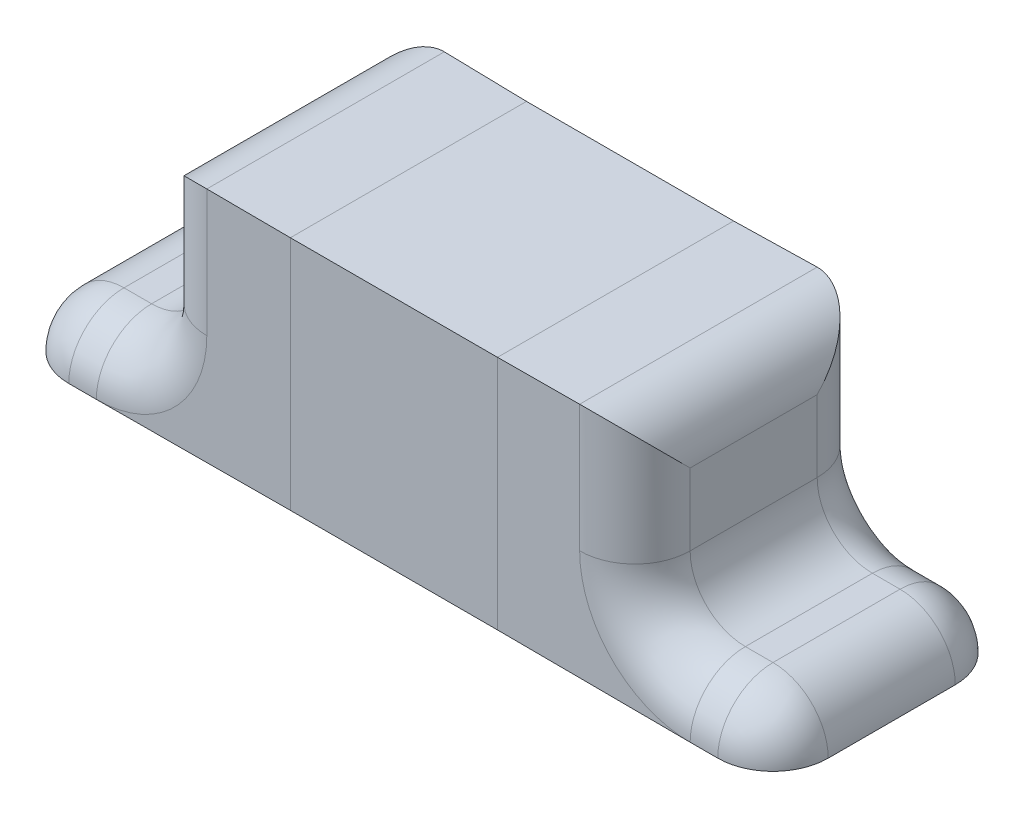
ISO-10303-21;
HEADER;
FILE_DESCRIPTION(('STEP AP214'),'2;1');
FILE_NAME('part.step','',(''),(''),'','','');
FILE_SCHEMA(('AUTOMOTIVE_DESIGN { 1 0 10303 214 1 1 1 1 }'));
ENDSEC;
DATA;
#1=APPLICATION_CONTEXT('core data for automotive mechanical design processes');
#2=APPLICATION_PROTOCOL_DEFINITION('international standard','automotive_design',2000,#1);
#3=PRODUCT_CONTEXT('',#1,'mechanical');
#4=PRODUCT('Part','Part','',(#3));
#5=PRODUCT_RELATED_PRODUCT_CATEGORY('part','',(#4));
#6=PRODUCT_DEFINITION_FORMATION('','',#4);
#7=PRODUCT_DEFINITION_CONTEXT('part definition',#1,'design');
#8=PRODUCT_DEFINITION('design','',#6,#7);
#9=PRODUCT_DEFINITION_SHAPE('','',#8);
#10=(LENGTH_UNIT() NAMED_UNIT(*) SI_UNIT(.MILLI.,.METRE.));
#11=(NAMED_UNIT(*) PLANE_ANGLE_UNIT() SI_UNIT($,.RADIAN.));
#12=(NAMED_UNIT(*) SI_UNIT($,.STERADIAN.) SOLID_ANGLE_UNIT());
#13=UNCERTAINTY_MEASURE_WITH_UNIT(LENGTH_MEASURE(1.E-05),#10,'distance_accuracy_value','');
#14=(GEOMETRIC_REPRESENTATION_CONTEXT(3) GLOBAL_UNCERTAINTY_ASSIGNED_CONTEXT((#13)) GLOBAL_UNIT_ASSIGNED_CONTEXT((#10,
#11,#12)) REPRESENTATION_CONTEXT('',''));
#15=CARTESIAN_POINT('',(0.,0.,0.));
#16=DIRECTION('',(0.,0.,1.));
#17=DIRECTION('',(1.,0.,0.));
#18=AXIS2_PLACEMENT_3D('',#15,#16,#17);
#19=CARTESIAN_POINT('',(0.875,0.,0.));
#20=DIRECTION('',(-1.,0.,0.));
#21=DIRECTION('',(0.,0.,1.));
#22=AXIS2_PLACEMENT_3D('',#19,#20,#21);
#23=PLANE('',#22);
#24=DIRECTION('',(0.,1.,0.));
#25=VECTOR('',#24,1.);
#26=CARTESIAN_POINT('',(0.875,0.,-0.23));
#27=LINE('',#26,#25);
#28=CARTESIAN_POINT('',(0.875,0.398442990090282,-0.23));
#29=VERTEX_POINT('',#28);
#30=CARTESIAN_POINT('',(0.875,0.658442990090282,-0.23));
#31=VERTEX_POINT('',#30);
#32=EDGE_CURVE('E896',#29,#31,#27,.T.);
#33=ORIENTED_EDGE('',*,*,#32,.T.);
#34=DIRECTION('',(0.,0.,1.));
#35=VECTOR('',#34,1.);
#36=CARTESIAN_POINT('',(0.875,0.658442990090282,0.));
#37=LINE('',#36,#35);
#38=CARTESIAN_POINT('',(0.875,0.658442990090282,0.23));
#39=VERTEX_POINT('',#38);
#40=EDGE_CURVE('E454',#31,#39,#37,.T.);
#41=ORIENTED_EDGE('',*,*,#40,.T.);
#42=DIRECTION('',(0.,-1.,0.));
#43=VECTOR('',#42,1.);
#44=CARTESIAN_POINT('',(0.875,0.,0.23));
#45=LINE('',#44,#43);
#46=CARTESIAN_POINT('',(0.875,0.398442990090282,0.23));
#47=VERTEX_POINT('',#46);
#48=EDGE_CURVE('E918',#39,#47,#45,.T.);
#49=ORIENTED_EDGE('',*,*,#48,.T.);
#50=DIRECTION('',(0.,0.,1.));
#51=VECTOR('',#50,1.);
#52=CARTESIAN_POINT('',(0.875,0.398442990090282,-0.43));
#53=LINE('',#52,#51);
#54=EDGE_CURVE('E249',#47,#29,#53,.F.);
#55=ORIENTED_EDGE('',*,*,#54,.T.);
#56=EDGE_LOOP('',(#33,#41,#49,#55));
#57=FACE_BOUND('',#56,.T.);
#58=ADVANCED_FACE('F38',(#57),#23,.F.);
#59=CARTESIAN_POINT('',(0.375,0.,-0.425));
#60=DIRECTION('',(0.,0.,1.));
#61=DIRECTION('',(1.,0.,0.));
#62=AXIS2_PLACEMENT_3D('',#59,#60,#61);
#63=PLANE('',#62);
#64=CARTESIAN_POINT('',(-0.375,0.,-0.425));
#65=DIRECTION('',(0.,1.,0.));
#66=VECTOR('',#65,1.);
#67=LINE('',#64,#66);
#68=CARTESIAN_POINT('',(-0.375,-0.000778504954858498,-0.4275));
#69=VERTEX_POINT('',#68);
#70=CARTESIAN_POINT('',(-0.375,0.854221495045141,-0.4275));
#71=VERTEX_POINT('',#70);
#72=EDGE_CURVE('E201',#69,#71,#67,.T.);
#73=ORIENTED_EDGE('',*,*,#72,.T.);
#74=DIRECTION('',(-1.,0.,0.));
#75=VECTOR('',#74,1.);
#76=CARTESIAN_POINT('',(0.375,0.850000000000001,-0.425));
#77=LINE('',#76,#75);
#78=CARTESIAN_POINT('',(0.375,0.854221495045141,-0.4275));
#79=VERTEX_POINT('',#78);
#80=EDGE_CURVE('E246',#79,#71,#77,.T.);
#81=ORIENTED_EDGE('',*,*,#80,.F.);
#82=CARTESIAN_POINT('',(0.375,-0.00155700990971792,-0.43));
#83=DIRECTION('',(0.,1.,0.));
#84=VECTOR('',#83,1.);
#85=LINE('',#82,#84);
#86=CARTESIAN_POINT('',(0.375,-0.000778504954858498,-0.4275));
#87=VERTEX_POINT('',#86);
#88=EDGE_CURVE('E226',#87,#79,#85,.T.);
#89=ORIENTED_EDGE('',*,*,#88,.F.);
#90=DIRECTION('',(-1.,0.,0.));
#91=VECTOR('',#90,1.);
#92=CARTESIAN_POINT('',(0.375,0.,-0.425));
#93=LINE('',#92,#91);
#94=EDGE_CURVE('E222',#87,#69,#93,.T.);
#95=ORIENTED_EDGE('',*,*,#94,.T.);
#96=EDGE_LOOP('',(#73,#81,#89,#95));
#97=FACE_BOUND('',#96,.T.);
#98=ADVANCED_FACE('F231',(#97),#63,.F.);
#99=CARTESIAN_POINT('',(0.375,0.850000000000001,0.425));
#100=DIRECTION('',(0.,-1.,0.));
#101=DIRECTION('',(0.,0.,-1.));
#102=AXIS2_PLACEMENT_3D('',#99,#100,#101);
#103=PLANE('',#102);
#104=CARTESIAN_POINT('',(-0.375,0.850000000000001,-0.425));
#105=DIRECTION('',(0.,0.,1.));
#106=VECTOR('',#105,1.);
#107=LINE('',#104,#106);
#108=CARTESIAN_POINT('',(-0.375,0.854221495045141,0.4275));
#109=VERTEX_POINT('',#108);
#110=EDGE_CURVE('E212',#71,#109,#107,.T.);
#111=ORIENTED_EDGE('',*,*,#110,.T.);
#112=DIRECTION('',(-1.,0.,0.));
#113=VECTOR('',#112,1.);
#114=CARTESIAN_POINT('',(0.375,0.850000000000001,0.425));
#115=LINE('',#114,#113);
#116=CARTESIAN_POINT('',(0.375,0.854221495045141,0.4275));
#117=VERTEX_POINT('',#116);
#118=EDGE_CURVE('E236',#117,#109,#115,.T.);
#119=ORIENTED_EDGE('',*,*,#118,.F.);
#120=CARTESIAN_POINT('',(0.375,0.858442990090282,-0.43));
#121=DIRECTION('',(0.,0.,1.));
#122=VECTOR('',#121,1.);
#123=LINE('',#120,#122);
#124=EDGE_CURVE('E257',#79,#117,#123,.T.);
#125=ORIENTED_EDGE('',*,*,#124,.F.);
#126=ORIENTED_EDGE('',*,*,#80,.T.);
#127=EDGE_LOOP('',(#111,#119,#125,#126));
#128=FACE_BOUND('',#127,.T.);
#129=ADVANCED_FACE('F263',(#128),#103,.F.);
#130=CARTESIAN_POINT('',(0.375,0.,0.425));
#131=DIRECTION('',(0.,0.,-1.));
#132=DIRECTION('',(-1.,0.,0.));
#133=AXIS2_PLACEMENT_3D('',#130,#131,#132);
#134=PLANE('',#133);
#135=CARTESIAN_POINT('',(-0.375,0.850000000000001,0.425));
#136=DIRECTION('',(0.,-1.,0.));
#137=VECTOR('',#136,1.);
#138=LINE('',#135,#137);
#139=CARTESIAN_POINT('',(-0.375,-0.000778504954858524,0.4275));
#140=VERTEX_POINT('',#139);
#141=EDGE_CURVE('E227',#109,#140,#138,.T.);
#142=ORIENTED_EDGE('',*,*,#141,.T.);
#143=DIRECTION('',(-1.,0.,0.));
#144=VECTOR('',#143,1.);
#145=CARTESIAN_POINT('',(0.375,0.,0.425));
#146=LINE('',#145,#144);
#147=CARTESIAN_POINT('',(0.375,-0.000778504954858524,0.4275));
#148=VERTEX_POINT('',#147);
#149=EDGE_CURVE('E225',#148,#140,#146,.T.);
#150=ORIENTED_EDGE('',*,*,#149,.F.);
#151=CARTESIAN_POINT('',(0.375,0.858442990090282,0.43));
#152=DIRECTION('',(0.,-1.,0.));
#153=VECTOR('',#152,1.);
#154=LINE('',#151,#153);
#155=EDGE_CURVE('E238',#117,#148,#154,.T.);
#156=ORIENTED_EDGE('',*,*,#155,.F.);
#157=ORIENTED_EDGE('',*,*,#118,.T.);
#158=EDGE_LOOP('',(#142,#150,#156,#157));
#159=FACE_BOUND('',#158,.T.);
#160=ADVANCED_FACE('F272',(#159),#134,.F.);
#161=CARTESIAN_POINT('',(0.375,0.,0.425));
#162=DIRECTION('',(0.,1.,0.));
#163=DIRECTION('',(0.,0.,1.));
#164=AXIS2_PLACEMENT_3D('',#161,#162,#163);
#165=PLANE('',#164);
#166=CARTESIAN_POINT('',(-0.375,0.,0.425));
#167=DIRECTION('',(0.,0.,-1.));
#168=VECTOR('',#167,1.);
#169=LINE('',#166,#168);
#170=EDGE_CURVE('E191',#140,#69,#169,.T.);
#171=ORIENTED_EDGE('',*,*,#170,.T.);
#172=ORIENTED_EDGE('',*,*,#94,.F.);
#173=CARTESIAN_POINT('',(0.375,-0.00155700990971797,0.43));
#174=DIRECTION('',(0.,0.,-1.));
#175=VECTOR('',#174,1.);
#176=LINE('',#173,#175);
#177=EDGE_CURVE('E234',#148,#87,#176,.T.);
#178=ORIENTED_EDGE('',*,*,#177,.F.);
#179=ORIENTED_EDGE('',*,*,#149,.T.);
#180=EDGE_LOOP('',(#171,#172,#178,#179));
#181=FACE_BOUND('',#180,.T.);
#182=ADVANCED_FACE('F220',(#181),#165,.F.);
#183=CARTESIAN_POINT('',(0.875,-0.00155700990971792,-0.43));
#184=DIRECTION('',(0.,0.,1.));
#185=DIRECTION('',(1.,0.,0.));
#186=AXIS2_PLACEMENT_3D('',#183,#184,#185);
#187=PLANE('',#186);
#188=DIRECTION('',(-1.,0.,0.));
#189=VECTOR('',#188,1.);
#190=CARTESIAN_POINT('',(0.875,0.858442990090282,-0.43));
#191=LINE('',#190,#189);
#192=CARTESIAN_POINT('',(0.675,0.858442990090282,-0.43));
#193=VERTEX_POINT('',#192);
#194=EDGE_CURVE('E213',#193,#79,#191,.T.);
#195=ORIENTED_EDGE('',*,*,#194,.F.);
#196=DIRECTION('',(0.,1.,0.));
#197=VECTOR('',#196,1.);
#198=CARTESIAN_POINT('',(0.675,-0.00155700990971792,-0.43));
#199=LINE('',#198,#197);
#200=CARTESIAN_POINT('',(0.675,0.398442990090282,-0.43));
#201=VERTEX_POINT('',#200);
#202=EDGE_CURVE('E453',#193,#201,#199,.F.);
#203=ORIENTED_EDGE('',*,*,#202,.T.);
#204=CARTESIAN_POINT('',(1.075,0.398442990090282,-0.43));
#205=DIRECTION('',(0.,0.,1.));
#206=DIRECTION('',(1.,0.,0.));
#207=AXIS2_PLACEMENT_3D('',#204,#205,#206);
#208=CIRCLE('',#207,0.4);
#209=CARTESIAN_POINT('',(1.075,-0.00155700990971792,-0.43));
#210=VERTEX_POINT('',#209);
#211=EDGE_CURVE('E450',#210,#201,#208,.F.);
#212=ORIENTED_EDGE('',*,*,#211,.F.);
#213=DIRECTION('',(-1.,0.,0.));
#214=VECTOR('',#213,1.);
#215=CARTESIAN_POINT('',(0.875,-0.00155700990971792,-0.43));
#216=LINE('',#215,#214);
#217=EDGE_CURVE('E445',#210,#87,#216,.T.);
#218=ORIENTED_EDGE('',*,*,#217,.T.);
#219=ORIENTED_EDGE('',*,*,#88,.T.);
#220=EDGE_LOOP('',(#195,#203,#212,#218,#219));
#221=FACE_BOUND('',#220,.T.);
#222=ADVANCED_FACE('F421',(#221),#187,.F.);
#223=CARTESIAN_POINT('',(0.875,0.858442990090282,0.43));
#224=DIRECTION('',(0.,-1.,0.));
#225=DIRECTION('',(0.,0.,-1.));
#226=AXIS2_PLACEMENT_3D('',#223,#224,#225);
#227=PLANE('',#226);
#228=DIRECTION('',(-1.,0.,0.));
#229=VECTOR('',#228,1.);
#230=CARTESIAN_POINT('',(0.875,0.858442990090282,0.43));
#231=LINE('',#230,#229);
#232=CARTESIAN_POINT('',(0.675,0.858442990090282,0.43));
#233=VERTEX_POINT('',#232);
#234=EDGE_CURVE('E399',#233,#117,#231,.T.);
#235=ORIENTED_EDGE('',*,*,#234,.F.);
#236=DIRECTION('',(0.,0.,1.));
#237=VECTOR('',#236,1.);
#238=CARTESIAN_POINT('',(0.675,0.858442990090282,0.43));
#239=LINE('',#238,#237);
#240=EDGE_CURVE('E911',#233,#193,#239,.F.);
#241=ORIENTED_EDGE('',*,*,#240,.T.);
#242=ORIENTED_EDGE('',*,*,#194,.T.);
#243=ORIENTED_EDGE('',*,*,#124,.T.);
#244=EDGE_LOOP('',(#235,#241,#242,#243));
#245=FACE_BOUND('',#244,.T.);
#246=ADVANCED_FACE('F398',(#245),#227,.F.);
#247=CARTESIAN_POINT('',(0.875,-0.00155700990971797,0.43));
#248=DIRECTION('',(0.,0.,-1.));
#249=DIRECTION('',(-1.,0.,0.));
#250=AXIS2_PLACEMENT_3D('',#247,#248,#249);
#251=PLANE('',#250);
#252=CARTESIAN_POINT('',(1.075,0.398442990090282,0.43));
#253=DIRECTION('',(0.,0.,-1.));
#254=DIRECTION('',(-1.,0.,0.));
#255=AXIS2_PLACEMENT_3D('',#252,#253,#254);
#256=CIRCLE('',#255,0.4);
#257=CARTESIAN_POINT('',(0.675,0.398442990090282,0.43));
#258=VERTEX_POINT('',#257);
#259=CARTESIAN_POINT('',(1.075,-0.00155700990971797,0.43));
#260=VERTEX_POINT('',#259);
#261=EDGE_CURVE('E457',#258,#260,#256,.F.);
#262=ORIENTED_EDGE('',*,*,#261,.F.);
#263=DIRECTION('',(0.,-1.,0.));
#264=VECTOR('',#263,1.);
#265=CARTESIAN_POINT('',(0.675,-0.00155700990971797,0.43));
#266=LINE('',#265,#264);
#267=EDGE_CURVE('E913',#258,#233,#266,.F.);
#268=ORIENTED_EDGE('',*,*,#267,.T.);
#269=ORIENTED_EDGE('',*,*,#234,.T.);
#270=ORIENTED_EDGE('',*,*,#155,.T.);
#271=DIRECTION('',(-1.,0.,0.));
#272=VECTOR('',#271,1.);
#273=CARTESIAN_POINT('',(0.875,-0.00155700990971797,0.43));
#274=LINE('',#273,#272);
#275=EDGE_CURVE('E458',#260,#148,#274,.T.);
#276=ORIENTED_EDGE('',*,*,#275,.F.);
#277=EDGE_LOOP('',(#262,#268,#269,#270,#276));
#278=FACE_BOUND('',#277,.T.);
#279=ADVANCED_FACE('F420',(#278),#251,.F.);
#280=CARTESIAN_POINT('',(0.875,-0.00155700990971797,0.43));
#281=DIRECTION('',(0.,1.,0.));
#282=DIRECTION('',(0.,0.,1.));
#283=AXIS2_PLACEMENT_3D('',#280,#281,#282);
#284=PLANE('',#283);
#285=CARTESIAN_POINT('',(1.175,-0.00155700990971792,-0.43));
#286=VERTEX_POINT('',#285);
#287=EDGE_CURVE('E441',#286,#210,#216,.T.);
#288=ORIENTED_EDGE('',*,*,#287,.F.);
#289=CARTESIAN_POINT('',(1.175,-0.00155700990971793,-0.23));
#290=DIRECTION('',(0.,1.,0.));
#291=DIRECTION('',(0.,0.,1.));
#292=AXIS2_PLACEMENT_3D('',#289,#290,#291);
#293=CIRCLE('',#292,0.2);
#294=CARTESIAN_POINT('',(1.375,-0.00155700990971797,-0.23));
#295=VERTEX_POINT('',#294);
#296=EDGE_CURVE('E475',#286,#295,#293,.F.);
#297=ORIENTED_EDGE('',*,*,#296,.T.);
#298=DIRECTION('',(0.,0.,-1.));
#299=VECTOR('',#298,1.);
#300=CARTESIAN_POINT('',(1.375,-0.00155700990971797,0.43));
#301=LINE('',#300,#299);
#302=CARTESIAN_POINT('',(1.375,-0.00155700990971797,0.23));
#303=VERTEX_POINT('',#302);
#304=EDGE_CURVE('E448',#303,#295,#301,.T.);
#305=ORIENTED_EDGE('',*,*,#304,.F.);
#306=CARTESIAN_POINT('',(1.175,-0.00155700990971796,0.23));
#307=DIRECTION('',(0.,1.,0.));
#308=DIRECTION('',(0.,0.,1.));
#309=AXIS2_PLACEMENT_3D('',#306,#307,#308);
#310=CIRCLE('',#309,0.2);
#311=CARTESIAN_POINT('',(1.175,-0.00155700990971797,0.43));
#312=VERTEX_POINT('',#311);
#313=EDGE_CURVE('E473',#303,#312,#310,.F.);
#314=ORIENTED_EDGE('',*,*,#313,.T.);
#315=EDGE_CURVE('E461',#312,#260,#274,.T.);
#316=ORIENTED_EDGE('',*,*,#315,.T.);
#317=ORIENTED_EDGE('',*,*,#275,.T.);
#318=ORIENTED_EDGE('',*,*,#177,.T.);
#319=ORIENTED_EDGE('',*,*,#217,.F.);
#320=EDGE_LOOP('',(#288,#297,#305,#314,#316,#317,#318,#319));
#321=FACE_BOUND('',#320,.T.);
#322=ADVANCED_FACE('F545',(#321),#284,.F.);
#323=CARTESIAN_POINT('',(1.375,0.198442990090282,0.43));
#324=DIRECTION('',(0.,-1.,0.));
#325=DIRECTION('',(0.,0.,-1.));
#326=AXIS2_PLACEMENT_3D('',#323,#324,#325);
#327=PLANE('',#326);
#328=DIRECTION('',(-1.,0.,0.));
#329=VECTOR('',#328,1.);
#330=CARTESIAN_POINT('',(1.375,0.198442990090282,-0.23));
#331=LINE('',#330,#329);
#332=CARTESIAN_POINT('',(1.175,0.198442990090282,-0.23));
#333=VERTEX_POINT('',#332);
#334=CARTESIAN_POINT('',(1.075,0.198442990090282,-0.23));
#335=VERTEX_POINT('',#334);
#336=EDGE_CURVE('E903',#333,#335,#331,.T.);
#337=ORIENTED_EDGE('',*,*,#336,.T.);
#338=DIRECTION('',(0.,0.,1.));
#339=VECTOR('',#338,1.);
#340=CARTESIAN_POINT('',(1.075,0.198442990090282,0.43));
#341=LINE('',#340,#339);
#342=CARTESIAN_POINT('',(1.075,0.198442990090282,0.23));
#343=VERTEX_POINT('',#342);
#344=EDGE_CURVE('E901',#335,#343,#341,.T.);
#345=ORIENTED_EDGE('',*,*,#344,.T.);
#346=DIRECTION('',(-1.,0.,0.));
#347=VECTOR('',#346,1.);
#348=CARTESIAN_POINT('',(1.375,0.198442990090282,0.23));
#349=LINE('',#348,#347);
#350=CARTESIAN_POINT('',(1.175,0.198442990090282,0.23));
#351=VERTEX_POINT('',#350);
#352=EDGE_CURVE('E906',#343,#351,#349,.F.);
#353=ORIENTED_EDGE('',*,*,#352,.T.);
#354=DIRECTION('',(0.,0.,1.));
#355=VECTOR('',#354,1.);
#356=CARTESIAN_POINT('',(1.175,0.198442990090282,0.43));
#357=LINE('',#356,#355);
#358=EDGE_CURVE('E908',#351,#333,#357,.F.);
#359=ORIENTED_EDGE('',*,*,#358,.T.);
#360=EDGE_LOOP('',(#337,#345,#353,#359));
#361=FACE_BOUND('',#360,.T.);
#362=ADVANCED_FACE('F544',(#361),#327,.F.);
#363=CARTESIAN_POINT('',(0.875,-0.00155700990971797,0.23));
#364=DIRECTION('',(-1.,0.,0.));
#365=DIRECTION('',(0.,0.,1.));
#366=AXIS2_PLACEMENT_3D('',#363,#364,#365);
#367=CYLINDRICAL_SURFACE('',#366,0.2);
#368=ORIENTED_EDGE('',*,*,#315,.F.);
#369=CARTESIAN_POINT('',(1.175,-0.00155700990971797,0.23));
#370=DIRECTION('',(-1.,0.,0.));
#371=DIRECTION('',(0.,0.,1.));
#372=AXIS2_PLACEMENT_3D('',#369,#370,#371);
#373=CIRCLE('',#372,0.2);
#374=EDGE_CURVE('E482',#312,#351,#373,.T.);
#375=ORIENTED_EDGE('',*,*,#374,.T.);
#376=ORIENTED_EDGE('',*,*,#352,.F.);
#377=CARTESIAN_POINT('',(1.075,-0.00155700990971797,0.23));
#378=DIRECTION('',(-1.,0.,0.));
#379=DIRECTION('',(0.,0.,1.));
#380=AXIS2_PLACEMENT_3D('',#377,#378,#379);
#381=CIRCLE('',#380,0.2);
#382=EDGE_CURVE('E594',#260,#343,#381,.T.);
#383=ORIENTED_EDGE('',*,*,#382,.F.);
#384=EDGE_LOOP('',(#368,#375,#376,#383));
#385=FACE_BOUND('',#384,.T.);
#386=ADVANCED_FACE('F560',(#385),#367,.T.);
#387=CARTESIAN_POINT('',(1.175,-0.00155700990971797,0.));
#388=DIRECTION('',(0.,0.,1.));
#389=DIRECTION('',(1.,0.,0.));
#390=AXIS2_PLACEMENT_3D('',#387,#388,#389);
#391=CYLINDRICAL_SURFACE('',#390,0.2);
#392=ORIENTED_EDGE('',*,*,#304,.T.);
#393=CARTESIAN_POINT('',(1.175,-0.00155700990971797,-0.23));
#394=DIRECTION('',(0.,0.,1.));
#395=DIRECTION('',(1.,0.,0.));
#396=AXIS2_PLACEMENT_3D('',#393,#394,#395);
#397=CIRCLE('',#396,0.2);
#398=EDGE_CURVE('E480',#295,#333,#397,.T.);
#399=ORIENTED_EDGE('',*,*,#398,.T.);
#400=ORIENTED_EDGE('',*,*,#358,.F.);
#401=CARTESIAN_POINT('',(1.175,-0.00155700990971797,0.23));
#402=DIRECTION('',(0.,0.,1.));
#403=DIRECTION('',(1.,0.,0.));
#404=AXIS2_PLACEMENT_3D('',#401,#402,#403);
#405=CIRCLE('',#404,0.2);
#406=EDGE_CURVE('E477',#351,#303,#405,.F.);
#407=ORIENTED_EDGE('',*,*,#406,.T.);
#408=EDGE_LOOP('',(#392,#399,#400,#407));
#409=FACE_BOUND('',#408,.T.);
#410=ADVANCED_FACE('F861',(#409),#391,.T.);
#411=CARTESIAN_POINT('',(1.075,0.398442990090282,0.23));
#412=DIRECTION('',(0.,0.,-1.));
#413=DIRECTION('',(-1.,0.,0.));
#414=AXIS2_PLACEMENT_3D('',#411,#412,#413);
#415=TOROIDAL_SURFACE('',#414,0.4,0.2);
#416=ORIENTED_EDGE('',*,*,#261,.T.);
#417=ORIENTED_EDGE('',*,*,#382,.T.);
#418=CARTESIAN_POINT('',(1.075,0.398442990090282,0.23));
#419=DIRECTION('',(0.,0.,-1.));
#420=DIRECTION('',(-1.,0.,0.));
#421=AXIS2_PLACEMENT_3D('',#418,#419,#420);
#422=CIRCLE('',#421,0.2);
#423=EDGE_CURVE('E587',#47,#343,#422,.F.);
#424=ORIENTED_EDGE('',*,*,#423,.F.);
#425=CARTESIAN_POINT('',(0.675,0.398442990090282,0.23));
#426=DIRECTION('',(0.,-1.,0.));
#427=DIRECTION('',(0.,0.,-1.));
#428=AXIS2_PLACEMENT_3D('',#425,#426,#427);
#429=CIRCLE('',#428,0.2);
#430=EDGE_CURVE('E584',#258,#47,#429,.F.);
#431=ORIENTED_EDGE('',*,*,#430,.F.);
#432=EDGE_LOOP('',(#416,#417,#424,#431));
#433=FACE_BOUND('',#432,.T.);
#434=ADVANCED_FACE('F852',(#433),#415,.T.);
#435=CARTESIAN_POINT('',(1.375,-0.00155700990971797,-0.23));
#436=DIRECTION('',(-1.,0.,0.));
#437=DIRECTION('',(0.,0.,1.));
#438=AXIS2_PLACEMENT_3D('',#435,#436,#437);
#439=CYLINDRICAL_SURFACE('',#438,0.2);
#440=ORIENTED_EDGE('',*,*,#336,.F.);
#441=CARTESIAN_POINT('',(1.175,-0.00155700990971797,-0.23));
#442=DIRECTION('',(-1.,0.,0.));
#443=DIRECTION('',(0.,0.,1.));
#444=AXIS2_PLACEMENT_3D('',#441,#442,#443);
#445=CIRCLE('',#444,0.2);
#446=EDGE_CURVE('E472',#333,#286,#445,.T.);
#447=ORIENTED_EDGE('',*,*,#446,.T.);
#448=ORIENTED_EDGE('',*,*,#287,.T.);
#449=CARTESIAN_POINT('',(1.075,-0.00155700990971797,-0.23));
#450=DIRECTION('',(-1.,0.,0.));
#451=DIRECTION('',(0.,0.,1.));
#452=AXIS2_PLACEMENT_3D('',#449,#450,#451);
#453=CIRCLE('',#452,0.2);
#454=EDGE_CURVE('E573',#335,#210,#453,.T.);
#455=ORIENTED_EDGE('',*,*,#454,.F.);
#456=EDGE_LOOP('',(#440,#447,#448,#455));
#457=FACE_BOUND('',#456,.T.);
#458=ADVANCED_FACE('F572',(#457),#439,.T.);
#459=CARTESIAN_POINT('',(1.075,0.398442990090282,0.43));
#460=DIRECTION('',(0.,0.,-1.));
#461=DIRECTION('',(-1.,0.,0.));
#462=AXIS2_PLACEMENT_3D('',#459,#460,#461);
#463=CYLINDRICAL_SURFACE('',#462,0.2);
#464=ORIENTED_EDGE('',*,*,#423,.T.);
#465=ORIENTED_EDGE('',*,*,#344,.F.);
#466=CARTESIAN_POINT('',(1.075,0.398442990090282,-0.23));
#467=DIRECTION('',(0.,0.,1.));
#468=DIRECTION('',(1.,0.,0.));
#469=AXIS2_PLACEMENT_3D('',#466,#467,#468);
#470=CIRCLE('',#469,0.2);
#471=EDGE_CURVE('E583',#29,#335,#470,.T.);
#472=ORIENTED_EDGE('',*,*,#471,.F.);
#473=ORIENTED_EDGE('',*,*,#54,.F.);
#474=EDGE_LOOP('',(#464,#465,#472,#473));
#475=FACE_BOUND('',#474,.T.);
#476=ADVANCED_FACE('F851',(#475),#463,.F.);
#477=CARTESIAN_POINT('',(0.675,0.,0.23));
#478=DIRECTION('',(0.,-1.,0.));
#479=DIRECTION('',(0.,0.,-1.));
#480=AXIS2_PLACEMENT_3D('',#477,#478,#479);
#481=CYLINDRICAL_SURFACE('',#480,0.2);
#482=ORIENTED_EDGE('',*,*,#430,.T.);
#483=ORIENTED_EDGE('',*,*,#48,.F.);
#484=CARTESIAN_POINT('',(0.675,0.658442990090282,0.23));
#485=DIRECTION('',(0.,-0.707106781186547,0.707106781186547));
#486=DIRECTION('',(0.,0.707106781186547,0.707106781186547));
#487=AXIS2_PLACEMENT_3D('',#484,#485,#486);
#488=ELLIPSE('',#487,0.282842712474619,0.2);
#489=EDGE_CURVE('E589',#233,#39,#488,.F.);
#490=ORIENTED_EDGE('',*,*,#489,.F.);
#491=ORIENTED_EDGE('',*,*,#267,.F.);
#492=EDGE_LOOP('',(#482,#483,#490,#491));
#493=FACE_BOUND('',#492,.T.);
#494=ADVANCED_FACE('F883',(#493),#481,.T.);
#495=CARTESIAN_POINT('',(1.075,0.398442990090282,-0.23));
#496=DIRECTION('',(0.,0.,1.));
#497=DIRECTION('',(1.,0.,0.));
#498=AXIS2_PLACEMENT_3D('',#495,#496,#497);
#499=TOROIDAL_SURFACE('',#498,0.4,0.2);
#500=ORIENTED_EDGE('',*,*,#454,.T.);
#501=ORIENTED_EDGE('',*,*,#211,.T.);
#502=CARTESIAN_POINT('',(0.675,0.398442990090282,-0.23));
#503=DIRECTION('',(0.,-1.,0.));
#504=DIRECTION('',(0.,0.,-1.));
#505=AXIS2_PLACEMENT_3D('',#502,#503,#504);
#506=CIRCLE('',#505,0.2);
#507=EDGE_CURVE('E580',#29,#201,#506,.F.);
#508=ORIENTED_EDGE('',*,*,#507,.F.);
#509=ORIENTED_EDGE('',*,*,#471,.T.);
#510=EDGE_LOOP('',(#500,#501,#508,#509));
#511=FACE_BOUND('',#510,.T.);
#512=ADVANCED_FACE('F579',(#511),#499,.T.);
#513=CARTESIAN_POINT('',(0.675,0.658442990090282,0.));
#514=DIRECTION('',(0.,0.,1.));
#515=DIRECTION('',(1.,0.,0.));
#516=AXIS2_PLACEMENT_3D('',#513,#514,#515);
#517=CYLINDRICAL_SURFACE('',#516,0.2);
#518=ORIENTED_EDGE('',*,*,#489,.T.);
#519=ORIENTED_EDGE('',*,*,#40,.F.);
#520=CARTESIAN_POINT('',(0.675,0.658442990090282,-0.23));
#521=DIRECTION('',(0.,0.707106781186547,0.707106781186547));
#522=DIRECTION('',(0.,-0.707106781186547,0.707106781186547));
#523=AXIS2_PLACEMENT_3D('',#520,#521,#522);
#524=ELLIPSE('',#523,0.282842712474619,0.2);
#525=EDGE_CURVE('E302',#193,#31,#524,.F.);
#526=ORIENTED_EDGE('',*,*,#525,.F.);
#527=ORIENTED_EDGE('',*,*,#240,.F.);
#528=EDGE_LOOP('',(#518,#519,#526,#527));
#529=FACE_BOUND('',#528,.T.);
#530=ADVANCED_FACE('F890',(#529),#517,.T.);
#531=CARTESIAN_POINT('',(0.675,0.,-0.23));
#532=DIRECTION('',(0.,1.,0.));
#533=DIRECTION('',(0.,0.,1.));
#534=AXIS2_PLACEMENT_3D('',#531,#532,#533);
#535=CYLINDRICAL_SURFACE('',#534,0.2);
#536=ORIENTED_EDGE('',*,*,#507,.T.);
#537=ORIENTED_EDGE('',*,*,#202,.F.);
#538=ORIENTED_EDGE('',*,*,#525,.T.);
#539=ORIENTED_EDGE('',*,*,#32,.F.);
#540=EDGE_LOOP('',(#536,#537,#538,#539));
#541=FACE_BOUND('',#540,.T.);
#542=ADVANCED_FACE('F640',(#541),#535,.T.);
#543=CARTESIAN_POINT('',(1.175,-0.00155700990971797,-0.23));
#544=DIRECTION('',(0.,0.,1.));
#545=DIRECTION('',(1.,0.,0.));
#546=AXIS2_PLACEMENT_3D('',#543,#544,#545);
#547=SPHERICAL_SURFACE('',#546,0.2);
#548=ORIENTED_EDGE('',*,*,#446,.F.);
#549=ORIENTED_EDGE('',*,*,#398,.F.);
#550=ORIENTED_EDGE('',*,*,#296,.F.);
#551=EDGE_LOOP('',(#548,#549,#550));
#552=FACE_BOUND('',#551,.T.);
#553=ADVANCED_FACE('F634',(#552),#547,.T.);
#554=CARTESIAN_POINT('',(1.175,-0.00155700990971797,0.23));
#555=DIRECTION('',(0.,0.,1.));
#556=DIRECTION('',(1.,0.,0.));
#557=AXIS2_PLACEMENT_3D('',#554,#555,#556);
#558=SPHERICAL_SURFACE('',#557,0.2);
#559=ORIENTED_EDGE('',*,*,#406,.F.);
#560=ORIENTED_EDGE('',*,*,#374,.F.);
#561=ORIENTED_EDGE('',*,*,#313,.F.);
#562=EDGE_LOOP('',(#559,#560,#561));
#563=FACE_BOUND('',#562,.T.);
#564=ADVANCED_FACE('F630',(#563),#558,.T.);
#565=CARTESIAN_POINT('',(-0.875,-0.00155700990971792,-0.43));
#566=DIRECTION('',(0.,0.,-1.));
#567=DIRECTION('',(-1.,0.,0.));
#568=AXIS2_PLACEMENT_3D('',#565,#566,#567);
#569=PLANE('',#568);
#570=CARTESIAN_POINT('',(-1.075,0.398442990090282,-0.43));
#571=DIRECTION('',(0.,0.,-1.));
#572=DIRECTION('',(-1.,0.,0.));
#573=AXIS2_PLACEMENT_3D('',#570,#571,#572);
#574=CIRCLE('',#573,0.4);
#575=CARTESIAN_POINT('',(-0.675,0.398442990090282,-0.43));
#576=VERTEX_POINT('',#575);
#577=CARTESIAN_POINT('',(-1.075,-0.00155700990971792,-0.43));
#578=VERTEX_POINT('',#577);
#579=EDGE_CURVE('E483',#576,#578,#574,.T.);
#580=ORIENTED_EDGE('',*,*,#579,.F.);
#581=DIRECTION('',(0.,1.,0.));
#582=VECTOR('',#581,1.);
#583=CARTESIAN_POINT('',(-0.675,0.858442990090282,-0.43));
#584=LINE('',#583,#582);
#585=CARTESIAN_POINT('',(-0.675,0.858442990090282,-0.43));
#586=VERTEX_POINT('',#585);
#587=EDGE_CURVE('E497',#576,#586,#584,.T.);
#588=ORIENTED_EDGE('',*,*,#587,.T.);
#589=DIRECTION('',(1.,0.,0.));
#590=VECTOR('',#589,1.);
#591=CARTESIAN_POINT('',(-0.875,0.858442990090282,-0.43));
#592=LINE('',#591,#590);
#593=EDGE_CURVE('E206',#586,#71,#592,.T.);
#594=ORIENTED_EDGE('',*,*,#593,.T.);
#595=ORIENTED_EDGE('',*,*,#72,.F.);
#596=DIRECTION('',(1.,0.,0.));
#597=VECTOR('',#596,1.);
#598=CARTESIAN_POINT('',(-0.875,-0.00155700990971792,-0.43));
#599=LINE('',#598,#597);
#600=EDGE_CURVE('E186',#578,#69,#599,.T.);
#601=ORIENTED_EDGE('',*,*,#600,.F.);
#602=EDGE_LOOP('',(#580,#588,#594,#595,#601));
#603=FACE_BOUND('',#602,.T.);
#604=ADVANCED_FACE('F203',(#603),#569,.T.);
#605=CARTESIAN_POINT('',(-0.875,-0.00155700990971797,0.43));
#606=DIRECTION('',(0.,-1.,0.));
#607=DIRECTION('',(0.,0.,-1.));
#608=AXIS2_PLACEMENT_3D('',#605,#606,#607);
#609=PLANE('',#608);
#610=DIRECTION('',(0.,0.,-1.));
#611=VECTOR('',#610,1.);
#612=CARTESIAN_POINT('',(-1.375,-0.00155700990971797,0.43));
#613=LINE('',#612,#611);
#614=CARTESIAN_POINT('',(-1.375,-0.00155700990971797,0.23));
#615=VERTEX_POINT('',#614);
#616=CARTESIAN_POINT('',(-1.375,-0.00155700990971797,-0.23));
#617=VERTEX_POINT('',#616);
#618=EDGE_CURVE('E372',#615,#617,#613,.T.);
#619=ORIENTED_EDGE('',*,*,#618,.T.);
#620=CARTESIAN_POINT('',(-1.175,-0.00155700990971793,-0.23));
#621=DIRECTION('',(0.,-1.,0.));
#622=DIRECTION('',(0.,0.,-1.));
#623=AXIS2_PLACEMENT_3D('',#620,#621,#622);
#624=CIRCLE('',#623,0.2);
#625=CARTESIAN_POINT('',(-1.175,-0.00155700990971792,-0.43));
#626=VERTEX_POINT('',#625);
#627=EDGE_CURVE('E46',#617,#626,#624,.T.);
#628=ORIENTED_EDGE('',*,*,#627,.T.);
#629=EDGE_CURVE('E195',#626,#578,#599,.T.);
#630=ORIENTED_EDGE('',*,*,#629,.T.);
#631=ORIENTED_EDGE('',*,*,#600,.T.);
#632=ORIENTED_EDGE('',*,*,#170,.F.);
#633=DIRECTION('',(1.,0.,0.));
#634=VECTOR('',#633,1.);
#635=CARTESIAN_POINT('',(-0.875,-0.00155700990971797,0.43));
#636=LINE('',#635,#634);
#637=CARTESIAN_POINT('',(-1.075,-0.00155700990971797,0.43));
#638=VERTEX_POINT('',#637);
#639=EDGE_CURVE('E316',#638,#140,#636,.T.);
#640=ORIENTED_EDGE('',*,*,#639,.F.);
#641=CARTESIAN_POINT('',(-1.175,-0.00155700990971797,0.43));
#642=VERTEX_POINT('',#641);
#643=EDGE_CURVE('E198',#642,#638,#636,.T.);
#644=ORIENTED_EDGE('',*,*,#643,.F.);
#645=CARTESIAN_POINT('',(-1.175,-0.00155700990971796,0.23));
#646=DIRECTION('',(0.,-1.,0.));
#647=DIRECTION('',(0.,0.,-1.));
#648=AXIS2_PLACEMENT_3D('',#645,#646,#647);
#649=CIRCLE('',#648,0.2);
#650=EDGE_CURVE('E313',#642,#615,#649,.T.);
#651=ORIENTED_EDGE('',*,*,#650,.T.);
#652=EDGE_LOOP('',(#619,#628,#630,#631,#632,#640,#644,#651));
#653=FACE_BOUND('',#652,.T.);
#654=ADVANCED_FACE('F188',(#653),#609,.T.);
#655=CARTESIAN_POINT('',(-0.875,-0.00155700990971797,0.43));
#656=DIRECTION('',(0.,0.,1.));
#657=DIRECTION('',(1.,0.,0.));
#658=AXIS2_PLACEMENT_3D('',#655,#656,#657);
#659=PLANE('',#658);
#660=DIRECTION('',(1.,0.,0.));
#661=VECTOR('',#660,1.);
#662=CARTESIAN_POINT('',(-0.875,0.858442990090282,0.43));
#663=LINE('',#662,#661);
#664=CARTESIAN_POINT('',(-0.675,0.858442990090282,0.43));
#665=VERTEX_POINT('',#664);
#666=EDGE_CURVE('E329',#665,#109,#663,.T.);
#667=ORIENTED_EDGE('',*,*,#666,.F.);
#668=DIRECTION('',(0.,-1.,0.));
#669=VECTOR('',#668,1.);
#670=CARTESIAN_POINT('',(-0.675,0.198442990090282,0.43));
#671=LINE('',#670,#669);
#672=CARTESIAN_POINT('',(-0.675,0.398442990090282,0.43));
#673=VERTEX_POINT('',#672);
#674=EDGE_CURVE('E335',#665,#673,#671,.T.);
#675=ORIENTED_EDGE('',*,*,#674,.T.);
#676=CARTESIAN_POINT('',(-1.075,0.398442990090282,0.43));
#677=DIRECTION('',(0.,0.,1.));
#678=DIRECTION('',(1.,0.,0.));
#679=AXIS2_PLACEMENT_3D('',#676,#677,#678);
#680=CIRCLE('',#679,0.4);
#681=EDGE_CURVE('E332',#638,#673,#680,.T.);
#682=ORIENTED_EDGE('',*,*,#681,.F.);
#683=ORIENTED_EDGE('',*,*,#639,.T.);
#684=ORIENTED_EDGE('',*,*,#141,.F.);
#685=EDGE_LOOP('',(#667,#675,#682,#683,#684));
#686=FACE_BOUND('',#685,.T.);
#687=ADVANCED_FACE('F383',(#686),#659,.T.);
#688=CARTESIAN_POINT('',(-0.875,0.858442990090282,0.43));
#689=DIRECTION('',(0.,1.,0.));
#690=DIRECTION('',(0.,0.,1.));
#691=AXIS2_PLACEMENT_3D('',#688,#689,#690);
#692=PLANE('',#691);
#693=ORIENTED_EDGE('',*,*,#593,.F.);
#694=DIRECTION('',(0.,0.,1.));
#695=VECTOR('',#694,1.);
#696=CARTESIAN_POINT('',(-0.675,0.858442990090282,0.43));
#697=LINE('',#696,#695);
#698=EDGE_CURVE('E338',#586,#665,#697,.T.);
#699=ORIENTED_EDGE('',*,*,#698,.T.);
#700=ORIENTED_EDGE('',*,*,#666,.T.);
#701=ORIENTED_EDGE('',*,*,#110,.F.);
#702=EDGE_LOOP('',(#693,#699,#700,#701));
#703=FACE_BOUND('',#702,.T.);
#704=ADVANCED_FACE('F378',(#703),#692,.T.);
#705=CARTESIAN_POINT('',(-0.875,0.,0.));
#706=DIRECTION('',(1.,0.,0.));
#707=DIRECTION('',(0.,0.,1.));
#708=AXIS2_PLACEMENT_3D('',#705,#706,#707);
#709=PLANE('',#708);
#710=DIRECTION('',(0.,-1.,0.));
#711=VECTOR('',#710,1.);
#712=CARTESIAN_POINT('',(-0.875,0.858442990090282,0.23));
#713=LINE('',#712,#711);
#714=CARTESIAN_POINT('',(-0.875,0.398442990090282,0.23));
#715=VERTEX_POINT('',#714);
#716=CARTESIAN_POINT('',(-0.875,0.658442990090282,0.23));
#717=VERTEX_POINT('',#716);
#718=EDGE_CURVE('E504',#715,#717,#713,.F.);
#719=ORIENTED_EDGE('',*,*,#718,.T.);
#720=DIRECTION('',(0.,0.,1.));
#721=VECTOR('',#720,1.);
#722=CARTESIAN_POINT('',(-0.875,0.658442990090282,-0.43));
#723=LINE('',#722,#721);
#724=CARTESIAN_POINT('',(-0.875,0.658442990090282,-0.23));
#725=VERTEX_POINT('',#724);
#726=EDGE_CURVE('E336',#717,#725,#723,.F.);
#727=ORIENTED_EDGE('',*,*,#726,.T.);
#728=DIRECTION('',(0.,1.,0.));
#729=VECTOR('',#728,1.);
#730=CARTESIAN_POINT('',(-0.875,0.198442990090282,-0.23));
#731=LINE('',#730,#729);
#732=CARTESIAN_POINT('',(-0.875,0.398442990090282,-0.23));
#733=VERTEX_POINT('',#732);
#734=EDGE_CURVE('E506',#725,#733,#731,.F.);
#735=ORIENTED_EDGE('',*,*,#734,.T.);
#736=DIRECTION('',(0.,0.,1.));
#737=VECTOR('',#736,1.);
#738=CARTESIAN_POINT('',(-0.875,0.398442990090282,0.));
#739=LINE('',#738,#737);
#740=EDGE_CURVE('E500',#733,#715,#739,.T.);
#741=ORIENTED_EDGE('',*,*,#740,.T.);
#742=EDGE_LOOP('',(#719,#727,#735,#741));
#743=FACE_BOUND('',#742,.T.);
#744=ADVANCED_FACE('F511',(#743),#709,.F.);
#745=CARTESIAN_POINT('',(-1.375,0.198442990090282,0.43));
#746=DIRECTION('',(0.,1.,0.));
#747=DIRECTION('',(0.,0.,1.));
#748=AXIS2_PLACEMENT_3D('',#745,#746,#747);
#749=PLANE('',#748);
#750=DIRECTION('',(1.,0.,0.));
#751=VECTOR('',#750,1.);
#752=CARTESIAN_POINT('',(-1.375,0.198442990090282,0.23));
#753=LINE('',#752,#751);
#754=CARTESIAN_POINT('',(-1.175,0.198442990090282,0.23));
#755=VERTEX_POINT('',#754);
#756=CARTESIAN_POINT('',(-1.075,0.198442990090282,0.23));
#757=VERTEX_POINT('',#756);
#758=EDGE_CURVE('E343',#755,#757,#753,.T.);
#759=ORIENTED_EDGE('',*,*,#758,.T.);
#760=DIRECTION('',(0.,0.,1.));
#761=VECTOR('',#760,1.);
#762=CARTESIAN_POINT('',(-1.075,0.198442990090282,0.43));
#763=LINE('',#762,#761);
#764=CARTESIAN_POINT('',(-1.075,0.198442990090282,-0.23));
#765=VERTEX_POINT('',#764);
#766=EDGE_CURVE('E309',#757,#765,#763,.F.);
#767=ORIENTED_EDGE('',*,*,#766,.T.);
#768=DIRECTION('',(1.,0.,0.));
#769=VECTOR('',#768,1.);
#770=CARTESIAN_POINT('',(-1.375,0.198442990090282,-0.23));
#771=LINE('',#770,#769);
#772=CARTESIAN_POINT('',(-1.175,0.198442990090282,-0.23));
#773=VERTEX_POINT('',#772);
#774=EDGE_CURVE('E345',#765,#773,#771,.F.);
#775=ORIENTED_EDGE('',*,*,#774,.T.);
#776=DIRECTION('',(0.,0.,1.));
#777=VECTOR('',#776,1.);
#778=CARTESIAN_POINT('',(-1.175,0.198442990090282,0.43));
#779=LINE('',#778,#777);
#780=EDGE_CURVE('E340',#773,#755,#779,.T.);
#781=ORIENTED_EDGE('',*,*,#780,.T.);
#782=EDGE_LOOP('',(#759,#767,#775,#781));
#783=FACE_BOUND('',#782,.T.);
#784=ADVANCED_FACE('F671',(#783),#749,.T.);
#785=CARTESIAN_POINT('',(-1.375,-0.00155700990971797,0.23));
#786=DIRECTION('',(1.,0.,0.));
#787=DIRECTION('',(0.,0.,-1.));
#788=AXIS2_PLACEMENT_3D('',#785,#786,#787);
#789=CYLINDRICAL_SURFACE('',#788,0.2);
#790=ORIENTED_EDGE('',*,*,#758,.F.);
#791=CARTESIAN_POINT('',(-1.175,-0.00155700990971797,0.23));
#792=DIRECTION('',(1.,0.,0.));
#793=DIRECTION('',(0.,0.,-1.));
#794=AXIS2_PLACEMENT_3D('',#791,#792,#793);
#795=CIRCLE('',#794,0.2);
#796=EDGE_CURVE('E11',#755,#642,#795,.T.);
#797=ORIENTED_EDGE('',*,*,#796,.T.);
#798=ORIENTED_EDGE('',*,*,#643,.T.);
#799=CARTESIAN_POINT('',(-1.075,-0.00155700990971797,0.23));
#800=DIRECTION('',(1.,0.,0.));
#801=DIRECTION('',(0.,0.,-1.));
#802=AXIS2_PLACEMENT_3D('',#799,#800,#801);
#803=CIRCLE('',#802,0.2);
#804=EDGE_CURVE('E303',#757,#638,#803,.T.);
#805=ORIENTED_EDGE('',*,*,#804,.F.);
#806=EDGE_LOOP('',(#790,#797,#798,#805));
#807=FACE_BOUND('',#806,.T.);
#808=ADVANCED_FACE('F668',(#807),#789,.T.);
#809=CARTESIAN_POINT('',(-1.175,-0.00155700990971797,0.43));
#810=DIRECTION('',(0.,0.,-1.));
#811=DIRECTION('',(-1.,0.,0.));
#812=AXIS2_PLACEMENT_3D('',#809,#810,#811);
#813=CYLINDRICAL_SURFACE('',#812,0.2);
#814=ORIENTED_EDGE('',*,*,#780,.F.);
#815=CARTESIAN_POINT('',(-1.175,-0.00155700990971797,-0.23));
#816=DIRECTION('',(0.,0.,-1.));
#817=DIRECTION('',(-1.,0.,0.));
#818=AXIS2_PLACEMENT_3D('',#815,#816,#817);
#819=CIRCLE('',#818,0.2);
#820=EDGE_CURVE('E59',#773,#617,#819,.F.);
#821=ORIENTED_EDGE('',*,*,#820,.T.);
#822=ORIENTED_EDGE('',*,*,#618,.F.);
#823=CARTESIAN_POINT('',(-1.175,-0.00155700990971797,0.23));
#824=DIRECTION('',(0.,0.,-1.));
#825=DIRECTION('',(-1.,0.,0.));
#826=AXIS2_PLACEMENT_3D('',#823,#824,#825);
#827=CIRCLE('',#826,0.2);
#828=EDGE_CURVE('E308',#615,#755,#827,.T.);
#829=ORIENTED_EDGE('',*,*,#828,.T.);
#830=EDGE_LOOP('',(#814,#821,#822,#829));
#831=FACE_BOUND('',#830,.T.);
#832=ADVANCED_FACE('F534',(#831),#813,.T.);
#833=CARTESIAN_POINT('',(-1.075,0.398442990090282,0.23));
#834=DIRECTION('',(0.,0.,1.));
#835=DIRECTION('',(1.,0.,0.));
#836=AXIS2_PLACEMENT_3D('',#833,#834,#835);
#837=TOROIDAL_SURFACE('',#836,0.4,0.2);
#838=CARTESIAN_POINT('',(-0.675,0.398442990090282,0.23));
#839=DIRECTION('',(0.,-1.,0.));
#840=DIRECTION('',(0.,0.,-1.));
#841=AXIS2_PLACEMENT_3D('',#838,#839,#840);
#842=CIRCLE('',#841,0.2);
#843=EDGE_CURVE('E362',#715,#673,#842,.F.);
#844=ORIENTED_EDGE('',*,*,#843,.F.);
#845=CARTESIAN_POINT('',(-1.075,0.398442990090282,0.23));
#846=DIRECTION('',(0.,0.,1.));
#847=DIRECTION('',(1.,0.,0.));
#848=AXIS2_PLACEMENT_3D('',#845,#846,#847);
#849=CIRCLE('',#848,0.2);
#850=EDGE_CURVE('E364',#757,#715,#849,.T.);
#851=ORIENTED_EDGE('',*,*,#850,.F.);
#852=ORIENTED_EDGE('',*,*,#804,.T.);
#853=ORIENTED_EDGE('',*,*,#681,.T.);
#854=EDGE_LOOP('',(#844,#851,#852,#853));
#855=FACE_BOUND('',#854,.T.);
#856=ADVANCED_FACE('F525',(#855),#837,.T.);
#857=CARTESIAN_POINT('',(-1.075,0.398442990090282,0.));
#858=DIRECTION('',(0.,0.,1.));
#859=DIRECTION('',(1.,0.,0.));
#860=AXIS2_PLACEMENT_3D('',#857,#858,#859);
#861=CYLINDRICAL_SURFACE('',#860,0.2);
#862=ORIENTED_EDGE('',*,*,#850,.T.);
#863=ORIENTED_EDGE('',*,*,#740,.F.);
#864=CARTESIAN_POINT('',(-1.075,0.398442990090282,-0.23));
#865=DIRECTION('',(0.,0.,-1.));
#866=DIRECTION('',(-1.,0.,0.));
#867=AXIS2_PLACEMENT_3D('',#864,#865,#866);
#868=CIRCLE('',#867,0.2);
#869=EDGE_CURVE('E359',#765,#733,#868,.F.);
#870=ORIENTED_EDGE('',*,*,#869,.F.);
#871=ORIENTED_EDGE('',*,*,#766,.F.);
#872=EDGE_LOOP('',(#862,#863,#870,#871));
#873=FACE_BOUND('',#872,.T.);
#874=ADVANCED_FACE('F522',(#873),#861,.F.);
#875=CARTESIAN_POINT('',(-0.875,-0.00155700990971797,-0.23));
#876=DIRECTION('',(1.,0.,0.));
#877=DIRECTION('',(0.,0.,-1.));
#878=AXIS2_PLACEMENT_3D('',#875,#876,#877);
#879=CYLINDRICAL_SURFACE('',#878,0.2);
#880=ORIENTED_EDGE('',*,*,#629,.F.);
#881=CARTESIAN_POINT('',(-1.175,-0.00155700990971797,-0.23));
#882=DIRECTION('',(1.,0.,0.));
#883=DIRECTION('',(0.,0.,-1.));
#884=AXIS2_PLACEMENT_3D('',#881,#882,#883);
#885=CIRCLE('',#884,0.2);
#886=EDGE_CURVE('E305',#626,#773,#885,.T.);
#887=ORIENTED_EDGE('',*,*,#886,.T.);
#888=ORIENTED_EDGE('',*,*,#774,.F.);
#889=CARTESIAN_POINT('',(-1.075,-0.00155700990971797,-0.23));
#890=DIRECTION('',(1.,0.,0.));
#891=DIRECTION('',(0.,0.,-1.));
#892=AXIS2_PLACEMENT_3D('',#889,#890,#891);
#893=CIRCLE('',#892,0.2);
#894=EDGE_CURVE('E356',#578,#765,#893,.T.);
#895=ORIENTED_EDGE('',*,*,#894,.F.);
#896=EDGE_LOOP('',(#880,#887,#888,#895));
#897=FACE_BOUND('',#896,.T.);
#898=ADVANCED_FACE('F524',(#897),#879,.T.);
#899=CARTESIAN_POINT('',(-0.675,-0.00155700990971797,0.23));
#900=DIRECTION('',(0.,1.,0.));
#901=DIRECTION('',(0.,0.,1.));
#902=AXIS2_PLACEMENT_3D('',#899,#900,#901);
#903=CYLINDRICAL_SURFACE('',#902,0.2);
#904=ORIENTED_EDGE('',*,*,#843,.T.);
#905=ORIENTED_EDGE('',*,*,#674,.F.);
#906=CARTESIAN_POINT('',(-0.675,0.658442990090282,0.23));
#907=DIRECTION('',(0.,0.707106781186547,-0.707106781186547));
#908=DIRECTION('',(0.,-0.707106781186547,-0.707106781186547));
#909=AXIS2_PLACEMENT_3D('',#906,#907,#908);
#910=ELLIPSE('',#909,0.282842712474619,0.2);
#911=EDGE_CURVE('E353',#717,#665,#910,.T.);
#912=ORIENTED_EDGE('',*,*,#911,.F.);
#913=ORIENTED_EDGE('',*,*,#718,.F.);
#914=EDGE_LOOP('',(#904,#905,#912,#913));
#915=FACE_BOUND('',#914,.T.);
#916=ADVANCED_FACE('F531',(#915),#903,.T.);
#917=CARTESIAN_POINT('',(-1.075,0.398442990090282,-0.23));
#918=DIRECTION('',(0.,0.,-1.));
#919=DIRECTION('',(-1.,0.,0.));
#920=AXIS2_PLACEMENT_3D('',#917,#918,#919);
#921=TOROIDAL_SURFACE('',#920,0.4,0.2);
#922=ORIENTED_EDGE('',*,*,#894,.T.);
#923=ORIENTED_EDGE('',*,*,#869,.T.);
#924=CARTESIAN_POINT('',(-0.675,0.398442990090282,-0.23));
#925=DIRECTION('',(0.,-1.,0.));
#926=DIRECTION('',(0.,0.,-1.));
#927=AXIS2_PLACEMENT_3D('',#924,#925,#926);
#928=CIRCLE('',#927,0.2);
#929=EDGE_CURVE('E351',#576,#733,#928,.F.);
#930=ORIENTED_EDGE('',*,*,#929,.F.);
#931=ORIENTED_EDGE('',*,*,#579,.T.);
#932=EDGE_LOOP('',(#922,#923,#930,#931));
#933=FACE_BOUND('',#932,.T.);
#934=ADVANCED_FACE('F520',(#933),#921,.T.);
#935=CARTESIAN_POINT('',(-0.675,0.658442990090282,0.43));
#936=DIRECTION('',(0.,0.,-1.));
#937=DIRECTION('',(-1.,0.,0.));
#938=AXIS2_PLACEMENT_3D('',#935,#936,#937);
#939=CYLINDRICAL_SURFACE('',#938,0.2);
#940=ORIENTED_EDGE('',*,*,#911,.T.);
#941=ORIENTED_EDGE('',*,*,#698,.F.);
#942=CARTESIAN_POINT('',(-0.675,0.658442990090282,-0.23));
#943=DIRECTION('',(0.,-0.707106781186547,-0.707106781186547));
#944=DIRECTION('',(0.,0.707106781186547,-0.707106781186547));
#945=AXIS2_PLACEMENT_3D('',#942,#943,#944);
#946=ELLIPSE('',#945,0.282842712474619,0.2);
#947=EDGE_CURVE('E349',#725,#586,#946,.T.);
#948=ORIENTED_EDGE('',*,*,#947,.F.);
#949=ORIENTED_EDGE('',*,*,#726,.F.);
#950=EDGE_LOOP('',(#940,#941,#948,#949));
#951=FACE_BOUND('',#950,.T.);
#952=ADVANCED_FACE('F519',(#951),#939,.T.);
#953=CARTESIAN_POINT('',(-0.675,-0.00155700990971792,-0.23));
#954=DIRECTION('',(0.,-1.,0.));
#955=DIRECTION('',(0.,0.,-1.));
#956=AXIS2_PLACEMENT_3D('',#953,#954,#955);
#957=CYLINDRICAL_SURFACE('',#956,0.2);
#958=ORIENTED_EDGE('',*,*,#929,.T.);
#959=ORIENTED_EDGE('',*,*,#734,.F.);
#960=ORIENTED_EDGE('',*,*,#947,.T.);
#961=ORIENTED_EDGE('',*,*,#587,.F.);
#962=EDGE_LOOP('',(#958,#959,#960,#961));
#963=FACE_BOUND('',#962,.T.);
#964=ADVANCED_FACE('F517',(#963),#957,.T.);
#965=CARTESIAN_POINT('',(-1.175,-0.00155700990971797,-0.23));
#966=DIRECTION('',(0.,0.,1.));
#967=DIRECTION('',(1.,0.,0.));
#968=AXIS2_PLACEMENT_3D('',#965,#966,#967);
#969=SPHERICAL_SURFACE('',#968,0.2);
#970=ORIENTED_EDGE('',*,*,#627,.F.);
#971=ORIENTED_EDGE('',*,*,#820,.F.);
#972=ORIENTED_EDGE('',*,*,#886,.F.);
#973=EDGE_LOOP('',(#970,#971,#972));
#974=FACE_BOUND('',#973,.T.);
#975=ADVANCED_FACE('F648',(#974),#969,.T.);
#976=CARTESIAN_POINT('',(-1.175,-0.00155700990971797,0.23));
#977=DIRECTION('',(0.,0.,1.));
#978=DIRECTION('',(1.,0.,0.));
#979=AXIS2_PLACEMENT_3D('',#976,#977,#978);
#980=SPHERICAL_SURFACE('',#979,0.2);
#981=ORIENTED_EDGE('',*,*,#650,.F.);
#982=ORIENTED_EDGE('',*,*,#796,.F.);
#983=ORIENTED_EDGE('',*,*,#828,.F.);
#984=EDGE_LOOP('',(#981,#982,#983));
#985=FACE_BOUND('',#984,.T.);
#986=ADVANCED_FACE('F40',(#985),#980,.T.);
#987=CLOSED_SHELL('',(#58,#98,#129,#160,#182,#222,#246,#279,#322,#362,#386,#410,#434,#458,#476,
#494,#512,#530,#542,#553,#564,#604,#654,#687,#704,#744,#784,#808,#832,#856,#874,#898,#916,#934,
#952,#964,#975,#986));
#988=MANIFOLD_SOLID_BREP('B2',#987);
#989=ADVANCED_BREP_SHAPE_REPRESENTATION('',(#18,#988),#14);
#990=SHAPE_DEFINITION_REPRESENTATION(#9,#989);
ENDSEC;
END-ISO-10303-21;
